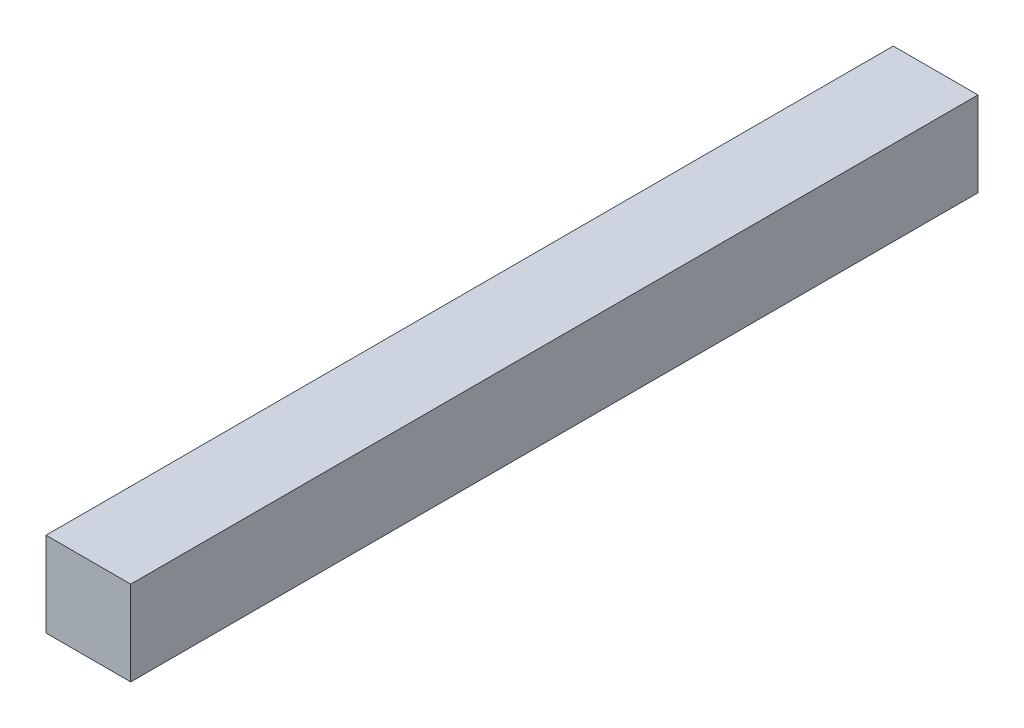
ISO-10303-21;
HEADER;
FILE_DESCRIPTION(('STEP AP214'),'2;1');
FILE_NAME('part.step','',(''),(''),'','','');
FILE_SCHEMA(('AUTOMOTIVE_DESIGN { 1 0 10303 214 1 1 1 1 }'));
ENDSEC;
DATA;
#1=APPLICATION_CONTEXT('core data for automotive mechanical design processes');
#2=APPLICATION_PROTOCOL_DEFINITION('international standard','automotive_design',2000,#1);
#3=PRODUCT_CONTEXT('',#1,'mechanical');
#4=PRODUCT('Part','Part','',(#3));
#5=PRODUCT_RELATED_PRODUCT_CATEGORY('part','',(#4));
#6=PRODUCT_DEFINITION_FORMATION('','',#4);
#7=PRODUCT_DEFINITION_CONTEXT('part definition',#1,'design');
#8=PRODUCT_DEFINITION('design','',#6,#7);
#9=PRODUCT_DEFINITION_SHAPE('','',#8);
#10=(LENGTH_UNIT() NAMED_UNIT(*) SI_UNIT(.MILLI.,.METRE.));
#11=(NAMED_UNIT(*) PLANE_ANGLE_UNIT() SI_UNIT($,.RADIAN.));
#12=(NAMED_UNIT(*) SI_UNIT($,.STERADIAN.) SOLID_ANGLE_UNIT());
#13=UNCERTAINTY_MEASURE_WITH_UNIT(LENGTH_MEASURE(1.E-05),#10,'distance_accuracy_value','');
#14=(GEOMETRIC_REPRESENTATION_CONTEXT(3) GLOBAL_UNCERTAINTY_ASSIGNED_CONTEXT((#13)) GLOBAL_UNIT_ASSIGNED_CONTEXT((#10,
#11,#12)) REPRESENTATION_CONTEXT('',''));
#15=CARTESIAN_POINT('',(0.,0.,0.));
#16=DIRECTION('',(0.,0.,1.));
#17=DIRECTION('',(1.,0.,0.));
#18=AXIS2_PLACEMENT_3D('',#15,#16,#17);
#19=CARTESIAN_POINT('',(-47.3075319204114,27.9508704312704,100.));
#20=DIRECTION('',(1.,0.,0.));
#21=DIRECTION('',(0.,0.,-1.));
#22=AXIS2_PLACEMENT_3D('',#19,#20,#21);
#23=PLANE('',#22);
#24=DIRECTION('',(0.,-1.,0.));
#25=VECTOR('',#24,1.);
#26=CARTESIAN_POINT('',(-47.3075319204114,27.9508704312704,0.));
#27=LINE('',#26,#25);
#28=CARTESIAN_POINT('',(-47.3075319204114,27.9508704312704,0.));
#29=VERTEX_POINT('',#28);
#30=CARTESIAN_POINT('',(-47.3075319204114,17.9508704312704,0.));
#31=VERTEX_POINT('',#30);
#32=EDGE_CURVE('E96',#29,#31,#27,.T.);
#33=ORIENTED_EDGE('',*,*,#32,.T.);
#34=DIRECTION('',(0.,0.,-1.));
#35=VECTOR('',#34,1.);
#36=CARTESIAN_POINT('',(-47.3075319204114,17.9508704312704,100.));
#37=LINE('',#36,#35);
#38=CARTESIAN_POINT('',(-47.3075319204114,17.9508704312704,100.));
#39=VERTEX_POINT('',#38);
#40=EDGE_CURVE('E11',#39,#31,#37,.T.);
#41=ORIENTED_EDGE('',*,*,#40,.F.);
#42=DIRECTION('',(0.,-1.,0.));
#43=VECTOR('',#42,1.);
#44=CARTESIAN_POINT('',(-47.3075319204114,27.9508704312704,100.));
#45=LINE('',#44,#43);
#46=CARTESIAN_POINT('',(-47.3075319204114,27.9508704312704,100.));
#47=VERTEX_POINT('',#46);
#48=EDGE_CURVE('E84',#47,#39,#45,.T.);
#49=ORIENTED_EDGE('',*,*,#48,.F.);
#50=DIRECTION('',(0.,0.,-1.));
#51=VECTOR('',#50,1.);
#52=CARTESIAN_POINT('',(-47.3075319204114,27.9508704312704,100.));
#53=LINE('',#52,#51);
#54=EDGE_CURVE('E92',#47,#29,#53,.T.);
#55=ORIENTED_EDGE('',*,*,#54,.T.);
#56=EDGE_LOOP('',(#33,#41,#49,#55));
#57=FACE_BOUND('',#56,.T.);
#58=ADVANCED_FACE('F33',(#57),#23,.F.);
#59=CARTESIAN_POINT('',(-47.3075319204114,17.9508704312704,100.));
#60=DIRECTION('',(0.,1.,0.));
#61=DIRECTION('',(0.,0.,1.));
#62=AXIS2_PLACEMENT_3D('',#59,#60,#61);
#63=PLANE('',#62);
#64=DIRECTION('',(1.,0.,0.));
#65=VECTOR('',#64,1.);
#66=CARTESIAN_POINT('',(-47.3075319204114,17.9508704312704,0.));
#67=LINE('',#66,#65);
#68=CARTESIAN_POINT('',(-37.3075319204114,17.9508704312704,0.));
#69=VERTEX_POINT('',#68);
#70=EDGE_CURVE('E88',#31,#69,#67,.T.);
#71=ORIENTED_EDGE('',*,*,#70,.T.);
#72=DIRECTION('',(0.,0.,-1.));
#73=VECTOR('',#72,1.);
#74=CARTESIAN_POINT('',(-37.3075319204114,17.9508704312704,100.));
#75=LINE('',#74,#73);
#76=CARTESIAN_POINT('',(-37.3075319204114,17.9508704312704,100.));
#77=VERTEX_POINT('',#76);
#78=EDGE_CURVE('E41',#77,#69,#75,.T.);
#79=ORIENTED_EDGE('',*,*,#78,.F.);
#80=DIRECTION('',(1.,0.,0.));
#81=VECTOR('',#80,1.);
#82=CARTESIAN_POINT('',(-47.3075319204114,17.9508704312704,100.));
#83=LINE('',#82,#81);
#84=EDGE_CURVE('E79',#39,#77,#83,.T.);
#85=ORIENTED_EDGE('',*,*,#84,.F.);
#86=ORIENTED_EDGE('',*,*,#40,.T.);
#87=EDGE_LOOP('',(#71,#79,#85,#86));
#88=FACE_BOUND('',#87,.T.);
#89=ADVANCED_FACE('F87',(#88),#63,.F.);
#90=CARTESIAN_POINT('',(-37.3075319204114,27.9508704312704,100.));
#91=DIRECTION('',(-1.,0.,0.));
#92=DIRECTION('',(0.,0.,1.));
#93=AXIS2_PLACEMENT_3D('',#90,#91,#92);
#94=PLANE('',#93);
#95=DIRECTION('',(0.,1.,0.));
#96=VECTOR('',#95,1.);
#97=CARTESIAN_POINT('',(-37.3075319204114,27.9508704312704,0.));
#98=LINE('',#97,#96);
#99=CARTESIAN_POINT('',(-37.3075319204114,27.9508704312704,0.));
#100=VERTEX_POINT('',#99);
#101=EDGE_CURVE('E66',#69,#100,#98,.T.);
#102=ORIENTED_EDGE('',*,*,#101,.T.);
#103=DIRECTION('',(0.,0.,-1.));
#104=VECTOR('',#103,1.);
#105=CARTESIAN_POINT('',(-37.3075319204114,27.9508704312704,100.));
#106=LINE('',#105,#104);
#107=CARTESIAN_POINT('',(-37.3075319204114,27.9508704312704,100.));
#108=VERTEX_POINT('',#107);
#109=EDGE_CURVE('E89',#108,#100,#106,.T.);
#110=ORIENTED_EDGE('',*,*,#109,.F.);
#111=DIRECTION('',(0.,1.,0.));
#112=VECTOR('',#111,1.);
#113=CARTESIAN_POINT('',(-37.3075319204114,27.9508704312704,100.));
#114=LINE('',#113,#112);
#115=EDGE_CURVE('E82',#77,#108,#114,.T.);
#116=ORIENTED_EDGE('',*,*,#115,.F.);
#117=ORIENTED_EDGE('',*,*,#78,.T.);
#118=EDGE_LOOP('',(#102,#110,#116,#117));
#119=FACE_BOUND('',#118,.T.);
#120=ADVANCED_FACE('F90',(#119),#94,.F.);
#121=CARTESIAN_POINT('',(-47.3075319204114,27.9508704312704,100.));
#122=DIRECTION('',(0.,-1.,0.));
#123=DIRECTION('',(0.,0.,-1.));
#124=AXIS2_PLACEMENT_3D('',#121,#122,#123);
#125=PLANE('',#124);
#126=DIRECTION('',(-1.,0.,0.));
#127=VECTOR('',#126,1.);
#128=CARTESIAN_POINT('',(-47.3075319204114,27.9508704312704,0.));
#129=LINE('',#128,#127);
#130=EDGE_CURVE('E72',#100,#29,#129,.T.);
#131=ORIENTED_EDGE('',*,*,#130,.T.);
#132=ORIENTED_EDGE('',*,*,#54,.F.);
#133=DIRECTION('',(-1.,0.,0.));
#134=VECTOR('',#133,1.);
#135=CARTESIAN_POINT('',(-47.3075319204114,27.9508704312704,100.));
#136=LINE('',#135,#134);
#137=EDGE_CURVE('E49',#108,#47,#136,.T.);
#138=ORIENTED_EDGE('',*,*,#137,.F.);
#139=ORIENTED_EDGE('',*,*,#109,.T.);
#140=EDGE_LOOP('',(#131,#132,#138,#139));
#141=FACE_BOUND('',#140,.T.);
#142=ADVANCED_FACE('F103',(#141),#125,.F.);
#143=CARTESIAN_POINT('',(0.,0.,100.));
#144=DIRECTION('',(0.,0.,1.));
#145=DIRECTION('',(1.,0.,0.));
#146=AXIS2_PLACEMENT_3D('',#143,#144,#145);
#147=PLANE('',#146);
#148=ORIENTED_EDGE('',*,*,#48,.T.);
#149=ORIENTED_EDGE('',*,*,#84,.T.);
#150=ORIENTED_EDGE('',*,*,#115,.T.);
#151=ORIENTED_EDGE('',*,*,#137,.T.);
#152=EDGE_LOOP('',(#148,#149,#150,#151));
#153=FACE_BOUND('',#152,.T.);
#154=ADVANCED_FACE('F80',(#153),#147,.T.);
#155=CARTESIAN_POINT('',(0.,0.,0.));
#156=DIRECTION('',(0.,0.,1.));
#157=DIRECTION('',(1.,0.,0.));
#158=AXIS2_PLACEMENT_3D('',#155,#156,#157);
#159=PLANE('',#158);
#160=ORIENTED_EDGE('',*,*,#32,.F.);
#161=ORIENTED_EDGE('',*,*,#130,.F.);
#162=ORIENTED_EDGE('',*,*,#101,.F.);
#163=ORIENTED_EDGE('',*,*,#70,.F.);
#164=EDGE_LOOP('',(#160,#161,#162,#163));
#165=FACE_BOUND('',#164,.T.);
#166=ADVANCED_FACE('F106',(#165),#159,.F.);
#167=CLOSED_SHELL('',(#58,#89,#120,#142,#154,#166));
#168=MANIFOLD_SOLID_BREP('B2',#167);
#169=ADVANCED_BREP_SHAPE_REPRESENTATION('',(#18,#168),#14);
#170=SHAPE_DEFINITION_REPRESENTATION(#9,#169);
ENDSEC;
END-ISO-10303-21;
